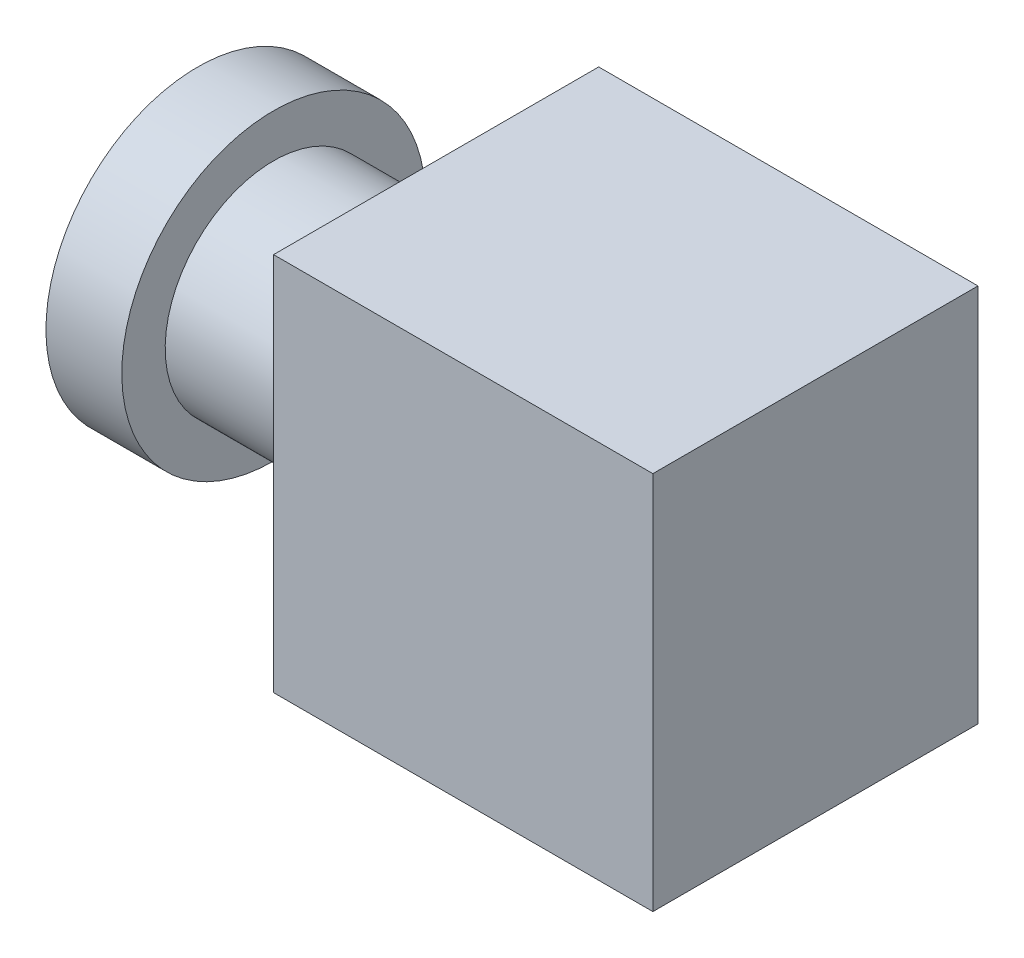
ISO-10303-21;
HEADER;
FILE_DESCRIPTION(('STEP AP214'),'2;1');
FILE_NAME('part.step','',(''),(''),'','','');
FILE_SCHEMA(('AUTOMOTIVE_DESIGN { 1 0 10303 214 1 1 1 1 }'));
ENDSEC;
DATA;
#1=APPLICATION_CONTEXT('core data for automotive mechanical design processes');
#2=APPLICATION_PROTOCOL_DEFINITION('international standard','automotive_design',2000,#1);
#3=PRODUCT_CONTEXT('',#1,'mechanical');
#4=PRODUCT('Part','Part','',(#3));
#5=PRODUCT_RELATED_PRODUCT_CATEGORY('part','',(#4));
#6=PRODUCT_DEFINITION_FORMATION('','',#4);
#7=PRODUCT_DEFINITION_CONTEXT('part definition',#1,'design');
#8=PRODUCT_DEFINITION('design','',#6,#7);
#9=PRODUCT_DEFINITION_SHAPE('','',#8);
#10=(LENGTH_UNIT() NAMED_UNIT(*) SI_UNIT(.MILLI.,.METRE.));
#11=(NAMED_UNIT(*) PLANE_ANGLE_UNIT() SI_UNIT($,.RADIAN.));
#12=(NAMED_UNIT(*) SI_UNIT($,.STERADIAN.) SOLID_ANGLE_UNIT());
#13=UNCERTAINTY_MEASURE_WITH_UNIT(LENGTH_MEASURE(1.E-05),#10,'distance_accuracy_value','');
#14=(GEOMETRIC_REPRESENTATION_CONTEXT(3) GLOBAL_UNCERTAINTY_ASSIGNED_CONTEXT((#13)) GLOBAL_UNIT_ASSIGNED_CONTEXT((#10,
#11,#12)) REPRESENTATION_CONTEXT('',''));
#15=CARTESIAN_POINT('',(0.,0.,0.));
#16=DIRECTION('',(0.,0.,1.));
#17=DIRECTION('',(1.,0.,0.));
#18=AXIS2_PLACEMENT_3D('',#15,#16,#17);
#19=CARTESIAN_POINT('',(17.5,17.5,30.));
#20=DIRECTION('',(-1.,0.,0.));
#21=DIRECTION('',(0.,-1.,0.));
#22=AXIS2_PLACEMENT_3D('',#19,#20,#21);
#23=PLANE('',#22);
#24=DIRECTION('',(0.,1.,0.));
#25=VECTOR('',#24,1.);
#26=CARTESIAN_POINT('',(17.5,17.5,0.));
#27=LINE('',#26,#25);
#28=CARTESIAN_POINT('',(17.5,-17.5,0.));
#29=VERTEX_POINT('',#28);
#30=CARTESIAN_POINT('',(17.5,17.5,0.));
#31=VERTEX_POINT('',#30);
#32=EDGE_CURVE('E110',#29,#31,#27,.T.);
#33=ORIENTED_EDGE('',*,*,#32,.T.);
#34=DIRECTION('',(0.,0.,-1.));
#35=VECTOR('',#34,1.);
#36=CARTESIAN_POINT('',(17.5,17.5,30.));
#37=LINE('',#36,#35);
#38=CARTESIAN_POINT('',(17.5,17.5,30.));
#39=VERTEX_POINT('',#38);
#40=EDGE_CURVE('E42',#39,#31,#37,.T.);
#41=ORIENTED_EDGE('',*,*,#40,.F.);
#42=DIRECTION('',(0.,1.,0.));
#43=VECTOR('',#42,1.);
#44=CARTESIAN_POINT('',(17.5,17.5,30.));
#45=LINE('',#44,#43);
#46=CARTESIAN_POINT('',(17.5,-17.5,30.));
#47=VERTEX_POINT('',#46);
#48=EDGE_CURVE('E93',#47,#39,#45,.T.);
#49=ORIENTED_EDGE('',*,*,#48,.F.);
#50=DIRECTION('',(0.,0.,-1.));
#51=VECTOR('',#50,1.);
#52=CARTESIAN_POINT('',(17.5,-17.5,30.));
#53=LINE('',#52,#51);
#54=EDGE_CURVE('E106',#47,#29,#53,.T.);
#55=ORIENTED_EDGE('',*,*,#54,.T.);
#56=EDGE_LOOP('',(#33,#41,#49,#55));
#57=FACE_BOUND('',#56,.T.);
#58=ADVANCED_FACE('F39',(#57),#23,.F.);
#59=CARTESIAN_POINT('',(-17.5,17.5,30.));
#60=DIRECTION('',(0.,-1.,0.));
#61=DIRECTION('',(0.,0.,-1.));
#62=AXIS2_PLACEMENT_3D('',#59,#60,#61);
#63=PLANE('',#62);
#64=DIRECTION('',(-1.,0.,0.));
#65=VECTOR('',#64,1.);
#66=CARTESIAN_POINT('',(-17.5,17.5,0.));
#67=LINE('',#66,#65);
#68=CARTESIAN_POINT('',(-17.5,17.5,0.));
#69=VERTEX_POINT('',#68);
#70=EDGE_CURVE('E99',#31,#69,#67,.T.);
#71=ORIENTED_EDGE('',*,*,#70,.T.);
#72=DIRECTION('',(0.,0.,-1.));
#73=VECTOR('',#72,1.);
#74=CARTESIAN_POINT('',(-17.5,17.5,30.));
#75=LINE('',#74,#73);
#76=CARTESIAN_POINT('',(-17.5,17.5,30.));
#77=VERTEX_POINT('',#76);
#78=EDGE_CURVE('E97',#77,#69,#75,.T.);
#79=ORIENTED_EDGE('',*,*,#78,.F.);
#80=DIRECTION('',(-1.,0.,0.));
#81=VECTOR('',#80,1.);
#82=CARTESIAN_POINT('',(-17.5,17.5,30.));
#83=LINE('',#82,#81);
#84=EDGE_CURVE('E88',#39,#77,#83,.T.);
#85=ORIENTED_EDGE('',*,*,#84,.F.);
#86=ORIENTED_EDGE('',*,*,#40,.T.);
#87=EDGE_LOOP('',(#71,#79,#85,#86));
#88=FACE_BOUND('',#87,.T.);
#89=ADVANCED_FACE('F98',(#88),#63,.F.);
#90=CARTESIAN_POINT('',(-17.5,17.5,30.));
#91=DIRECTION('',(1.,0.,0.));
#92=DIRECTION('',(0.,1.,0.));
#93=AXIS2_PLACEMENT_3D('',#90,#91,#92);
#94=PLANE('',#93);
#95=CARTESIAN_POINT('',(-17.5,0.,15.));
#96=DIRECTION('',(-1.,0.,0.));
#97=DIRECTION('',(0.,-1.,0.));
#98=AXIS2_PLACEMENT_3D('',#95,#96,#97);
#99=CIRCLE('',#98,10.);
#100=CARTESIAN_POINT('',(-17.5,-10.,15.));
#101=VERTEX_POINT('',#100);
#102=EDGE_CURVE('E11',#101,#101,#99,.T.);
#103=ORIENTED_EDGE('',*,*,#102,.F.);
#104=EDGE_LOOP('',(#103));
#105=FACE_BOUND('',#104,.T.);
#106=DIRECTION('',(0.,-1.,0.));
#107=VECTOR('',#106,1.);
#108=CARTESIAN_POINT('',(-17.5,17.5,0.));
#109=LINE('',#108,#107);
#110=CARTESIAN_POINT('',(-17.5,-17.5,0.));
#111=VERTEX_POINT('',#110);
#112=EDGE_CURVE('E74',#69,#111,#109,.T.);
#113=ORIENTED_EDGE('',*,*,#112,.T.);
#114=DIRECTION('',(0.,0.,-1.));
#115=VECTOR('',#114,1.);
#116=CARTESIAN_POINT('',(-17.5,-17.5,30.));
#117=LINE('',#116,#115);
#118=CARTESIAN_POINT('',(-17.5,-17.5,30.));
#119=VERTEX_POINT('',#118);
#120=EDGE_CURVE('E101',#119,#111,#117,.T.);
#121=ORIENTED_EDGE('',*,*,#120,.F.);
#122=DIRECTION('',(0.,-1.,0.));
#123=VECTOR('',#122,1.);
#124=CARTESIAN_POINT('',(-17.5,17.5,30.));
#125=LINE('',#124,#123);
#126=EDGE_CURVE('E91',#77,#119,#125,.T.);
#127=ORIENTED_EDGE('',*,*,#126,.F.);
#128=ORIENTED_EDGE('',*,*,#78,.T.);
#129=EDGE_LOOP('',(#113,#121,#127,#128));
#130=FACE_BOUND('',#129,.T.);
#131=ADVANCED_FACE('F102',(#105,#130),#94,.F.);
#132=CARTESIAN_POINT('',(-17.5,-17.5,30.));
#133=DIRECTION('',(0.,1.,0.));
#134=DIRECTION('',(0.,0.,1.));
#135=AXIS2_PLACEMENT_3D('',#132,#133,#134);
#136=PLANE('',#135);
#137=DIRECTION('',(1.,0.,0.));
#138=VECTOR('',#137,1.);
#139=CARTESIAN_POINT('',(-17.5,-17.5,0.));
#140=LINE('',#139,#138);
#141=EDGE_CURVE('E80',#111,#29,#140,.T.);
#142=ORIENTED_EDGE('',*,*,#141,.T.);
#143=ORIENTED_EDGE('',*,*,#54,.F.);
#144=DIRECTION('',(1.,0.,0.));
#145=VECTOR('',#144,1.);
#146=CARTESIAN_POINT('',(-17.5,-17.5,30.));
#147=LINE('',#146,#145);
#148=EDGE_CURVE('E57',#119,#47,#147,.T.);
#149=ORIENTED_EDGE('',*,*,#148,.F.);
#150=ORIENTED_EDGE('',*,*,#120,.T.);
#151=EDGE_LOOP('',(#142,#143,#149,#150));
#152=FACE_BOUND('',#151,.T.);
#153=ADVANCED_FACE('F124',(#152),#136,.F.);
#154=CARTESIAN_POINT('',(0.,0.,30.));
#155=DIRECTION('',(0.,0.,1.));
#156=DIRECTION('',(1.,0.,0.));
#157=AXIS2_PLACEMENT_3D('',#154,#155,#156);
#158=PLANE('',#157);
#159=ORIENTED_EDGE('',*,*,#48,.T.);
#160=ORIENTED_EDGE('',*,*,#84,.T.);
#161=ORIENTED_EDGE('',*,*,#126,.T.);
#162=ORIENTED_EDGE('',*,*,#148,.T.);
#163=EDGE_LOOP('',(#159,#160,#161,#162));
#164=FACE_BOUND('',#163,.T.);
#165=ADVANCED_FACE('F89',(#164),#158,.T.);
#166=CARTESIAN_POINT('',(0.,0.,0.));
#167=DIRECTION('',(0.,0.,1.));
#168=DIRECTION('',(1.,0.,0.));
#169=AXIS2_PLACEMENT_3D('',#166,#167,#168);
#170=PLANE('',#169);
#171=ORIENTED_EDGE('',*,*,#32,.F.);
#172=ORIENTED_EDGE('',*,*,#141,.F.);
#173=ORIENTED_EDGE('',*,*,#112,.F.);
#174=ORIENTED_EDGE('',*,*,#70,.F.);
#175=EDGE_LOOP('',(#171,#172,#173,#174));
#176=FACE_BOUND('',#175,.T.);
#177=ADVANCED_FACE('F127',(#176),#170,.F.);
#178=CARTESIAN_POINT('',(-32.5,0.,15.));
#179=DIRECTION('',(1.,0.,0.));
#180=DIRECTION('',(0.,1.,0.));
#181=AXIS2_PLACEMENT_3D('',#178,#179,#180);
#182=CYLINDRICAL_SURFACE('',#181,10.);
#183=CARTESIAN_POINT('',(-32.5,0.,15.));
#184=DIRECTION('',(-1.,0.,0.));
#185=DIRECTION('',(0.,-1.,0.));
#186=AXIS2_PLACEMENT_3D('',#183,#184,#185);
#187=CIRCLE('',#186,10.);
#188=CARTESIAN_POINT('',(-32.5,-10.,15.));
#189=VERTEX_POINT('',#188);
#190=EDGE_CURVE('E114',#189,#189,#187,.T.);
#191=ORIENTED_EDGE('',*,*,#190,.F.);
#192=EDGE_LOOP('',(#191));
#193=FACE_BOUND('',#192,.T.);
#194=ORIENTED_EDGE('',*,*,#102,.T.);
#195=EDGE_LOOP('',(#194));
#196=FACE_BOUND('',#195,.T.);
#197=ADVANCED_FACE('F148',(#193,#196),#182,.T.);
#198=CARTESIAN_POINT('',(-39.5,0.,15.));
#199=DIRECTION('',(1.,0.,0.));
#200=DIRECTION('',(0.,1.,0.));
#201=AXIS2_PLACEMENT_3D('',#198,#199,#200);
#202=CYLINDRICAL_SURFACE('',#201,14.);
#203=CARTESIAN_POINT('',(-39.5,0.,15.));
#204=DIRECTION('',(-1.,0.,0.));
#205=DIRECTION('',(0.,-1.,0.));
#206=AXIS2_PLACEMENT_3D('',#203,#204,#205);
#207=CIRCLE('',#206,14.);
#208=CARTESIAN_POINT('',(-39.5,-14.,15.));
#209=VERTEX_POINT('',#208);
#210=EDGE_CURVE('E134',#209,#209,#207,.T.);
#211=ORIENTED_EDGE('',*,*,#210,.F.);
#212=EDGE_LOOP('',(#211));
#213=FACE_BOUND('',#212,.T.);
#214=CARTESIAN_POINT('',(-32.5,0.,15.));
#215=DIRECTION('',(-1.,0.,0.));
#216=DIRECTION('',(0.,-1.,0.));
#217=AXIS2_PLACEMENT_3D('',#214,#215,#216);
#218=CIRCLE('',#217,14.);
#219=CARTESIAN_POINT('',(-32.5,-14.,15.));
#220=VERTEX_POINT('',#219);
#221=EDGE_CURVE('E135',#220,#220,#218,.T.);
#222=ORIENTED_EDGE('',*,*,#221,.T.);
#223=EDGE_LOOP('',(#222));
#224=FACE_BOUND('',#223,.T.);
#225=ADVANCED_FACE('F145',(#213,#224),#202,.T.);
#226=CARTESIAN_POINT('',(-39.5,0.,15.));
#227=DIRECTION('',(-1.,0.,0.));
#228=DIRECTION('',(0.,-1.,0.));
#229=AXIS2_PLACEMENT_3D('',#226,#227,#228);
#230=PLANE('',#229);
#231=ORIENTED_EDGE('',*,*,#210,.T.);
#232=EDGE_LOOP('',(#231));
#233=FACE_BOUND('',#232,.T.);
#234=ADVANCED_FACE('F143',(#233),#230,.T.);
#235=CARTESIAN_POINT('',(-32.5,0.,15.));
#236=DIRECTION('',(-1.,0.,0.));
#237=DIRECTION('',(0.,-1.,0.));
#238=AXIS2_PLACEMENT_3D('',#235,#236,#237);
#239=PLANE('',#238);
#240=ORIENTED_EDGE('',*,*,#190,.T.);
#241=EDGE_LOOP('',(#240));
#242=FACE_BOUND('',#241,.T.);
#243=ORIENTED_EDGE('',*,*,#221,.F.);
#244=EDGE_LOOP('',(#243));
#245=FACE_BOUND('',#244,.T.);
#246=ADVANCED_FACE('F152',(#242,#245),#239,.F.);
#247=CLOSED_SHELL('',(#58,#89,#131,#153,#165,#177,#197,#225,#234,#246));
#248=MANIFOLD_SOLID_BREP('B2',#247);
#249=ADVANCED_BREP_SHAPE_REPRESENTATION('',(#18,#248),#14);
#250=SHAPE_DEFINITION_REPRESENTATION(#9,#249);
ENDSEC;
END-ISO-10303-21;
